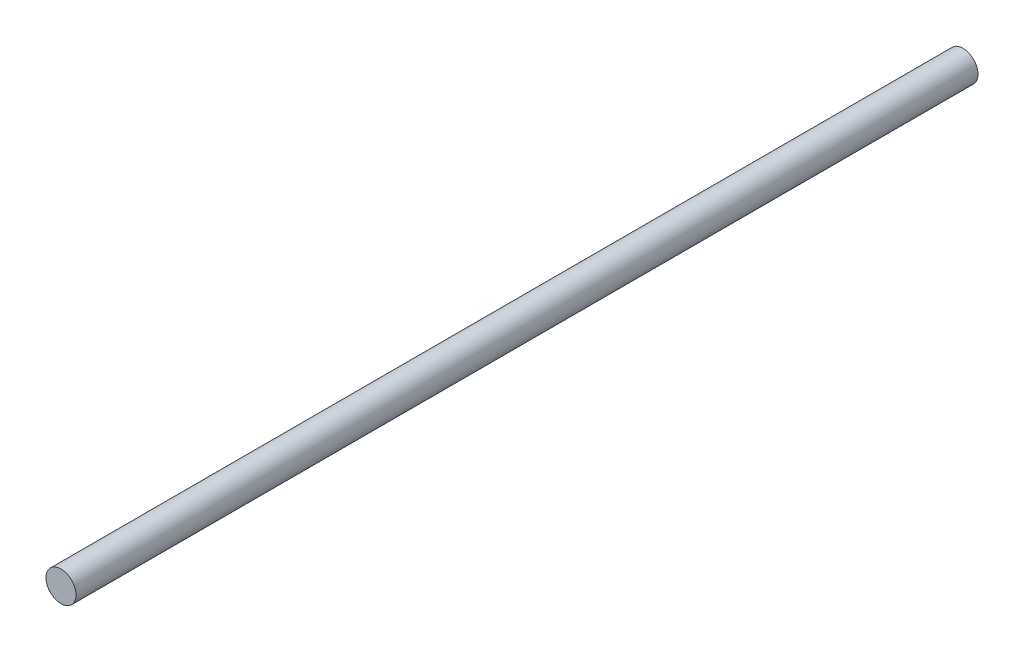
ISO-10303-21;
HEADER;
FILE_DESCRIPTION(('STEP AP214'),'2;1');
FILE_NAME('part.step','',(''),(''),'','','');
FILE_SCHEMA(('AUTOMOTIVE_DESIGN { 1 0 10303 214 1 1 1 1 }'));
ENDSEC;
DATA;
#1=APPLICATION_CONTEXT('core data for automotive mechanical design processes');
#2=APPLICATION_PROTOCOL_DEFINITION('international standard','automotive_design',2000,#1);
#3=PRODUCT_CONTEXT('',#1,'mechanical');
#4=PRODUCT('Part','Part','',(#3));
#5=PRODUCT_RELATED_PRODUCT_CATEGORY('part','',(#4));
#6=PRODUCT_DEFINITION_FORMATION('','',#4);
#7=PRODUCT_DEFINITION_CONTEXT('part definition',#1,'design');
#8=PRODUCT_DEFINITION('design','',#6,#7);
#9=PRODUCT_DEFINITION_SHAPE('','',#8);
#10=(LENGTH_UNIT() NAMED_UNIT(*) SI_UNIT(.MILLI.,.METRE.));
#11=(NAMED_UNIT(*) PLANE_ANGLE_UNIT() SI_UNIT($,.RADIAN.));
#12=(NAMED_UNIT(*) SI_UNIT($,.STERADIAN.) SOLID_ANGLE_UNIT());
#13=UNCERTAINTY_MEASURE_WITH_UNIT(LENGTH_MEASURE(1.E-05),#10,'distance_accuracy_value','');
#14=(GEOMETRIC_REPRESENTATION_CONTEXT(3) GLOBAL_UNCERTAINTY_ASSIGNED_CONTEXT((#13)) GLOBAL_UNIT_ASSIGNED_CONTEXT((#10,
#11,#12)) REPRESENTATION_CONTEXT('',''));
#15=CARTESIAN_POINT('',(0.,0.,0.));
#16=DIRECTION('',(0.,0.,1.));
#17=DIRECTION('',(1.,0.,0.));
#18=AXIS2_PLACEMENT_3D('',#15,#16,#17);
#19=CARTESIAN_POINT('',(0.,0.,18.));
#20=DIRECTION('',(0.,0.,-1.));
#21=DIRECTION('',(-1.,0.,0.));
#22=AXIS2_PLACEMENT_3D('',#19,#20,#21);
#23=CYLINDRICAL_SURFACE('',#22,0.3);
#24=CARTESIAN_POINT('',(0.,0.,18.));
#25=DIRECTION('',(0.,0.,1.));
#26=DIRECTION('',(1.,0.,0.));
#27=AXIS2_PLACEMENT_3D('',#24,#25,#26);
#28=CIRCLE('',#27,0.3);
#29=CARTESIAN_POINT('',(0.3,0.,18.));
#30=VERTEX_POINT('',#29);
#31=EDGE_CURVE('E10',#30,#30,#28,.T.);
#32=ORIENTED_EDGE('',*,*,#31,.F.);
#33=EDGE_LOOP('',(#32));
#34=FACE_BOUND('',#33,.T.);
#35=CARTESIAN_POINT('',(0.,0.,0.));
#36=DIRECTION('',(0.,0.,1.));
#37=DIRECTION('',(1.,0.,0.));
#38=AXIS2_PLACEMENT_3D('',#35,#36,#37);
#39=CIRCLE('',#38,0.3);
#40=CARTESIAN_POINT('',(0.3,0.,0.));
#41=VERTEX_POINT('',#40);
#42=EDGE_CURVE('E31',#41,#41,#39,.T.);
#43=ORIENTED_EDGE('',*,*,#42,.T.);
#44=EDGE_LOOP('',(#43));
#45=FACE_BOUND('',#44,.T.);
#46=ADVANCED_FACE('F28',(#34,#45),#23,.T.);
#47=CARTESIAN_POINT('',(0.,0.,18.));
#48=DIRECTION('',(0.,0.,1.));
#49=DIRECTION('',(1.,0.,0.));
#50=AXIS2_PLACEMENT_3D('',#47,#48,#49);
#51=PLANE('',#50);
#52=ORIENTED_EDGE('',*,*,#31,.T.);
#53=EDGE_LOOP('',(#52));
#54=FACE_BOUND('',#53,.T.);
#55=ADVANCED_FACE('F43',(#54),#51,.T.);
#56=CARTESIAN_POINT('',(0.,0.,0.));
#57=DIRECTION('',(0.,0.,1.));
#58=DIRECTION('',(1.,0.,0.));
#59=AXIS2_PLACEMENT_3D('',#56,#57,#58);
#60=PLANE('',#59);
#61=ORIENTED_EDGE('',*,*,#42,.F.);
#62=EDGE_LOOP('',(#61));
#63=FACE_BOUND('',#62,.T.);
#64=ADVANCED_FACE('F41',(#63),#60,.F.);
#65=CLOSED_SHELL('',(#46,#55,#64));
#66=MANIFOLD_SOLID_BREP('B2',#65);
#67=ADVANCED_BREP_SHAPE_REPRESENTATION('',(#18,#66),#14);
#68=SHAPE_DEFINITION_REPRESENTATION(#9,#67);
ENDSEC;
END-ISO-10303-21;
